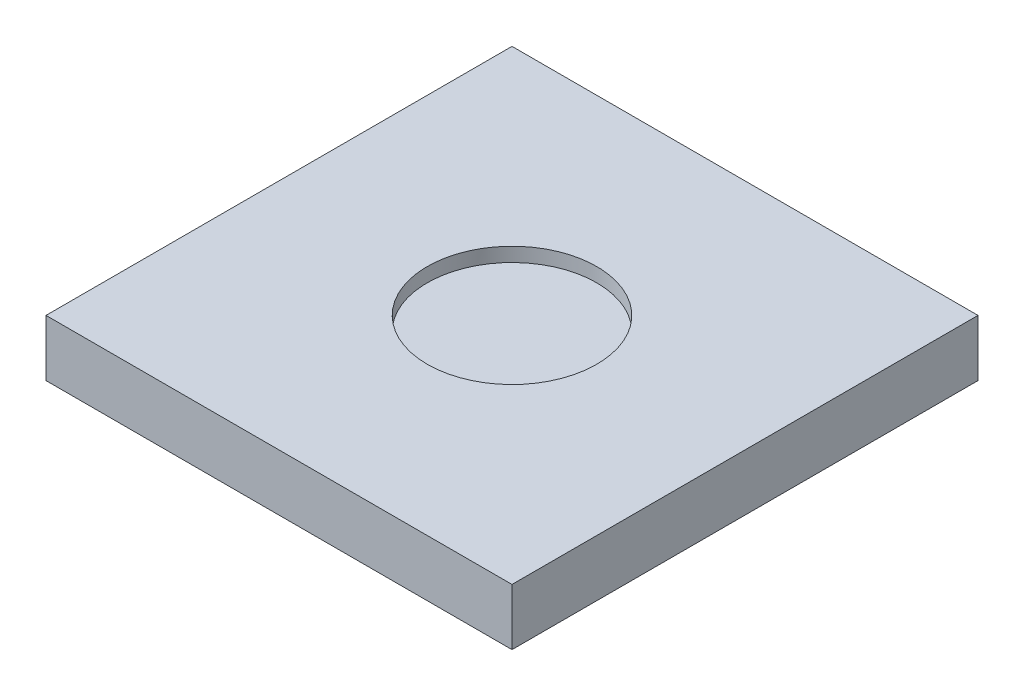
ISO-10303-21;
HEADER;
FILE_DESCRIPTION(('STEP AP214'),'2;1');
FILE_NAME('part.step','',(''),(''),'','','');
FILE_SCHEMA(('AUTOMOTIVE_DESIGN { 1 0 10303 214 1 1 1 1 }'));
ENDSEC;
DATA;
#1=APPLICATION_CONTEXT('core data for automotive mechanical design processes');
#2=APPLICATION_PROTOCOL_DEFINITION('international standard','automotive_design',2000,#1);
#3=PRODUCT_CONTEXT('',#1,'mechanical');
#4=PRODUCT('Part','Part','',(#3));
#5=PRODUCT_RELATED_PRODUCT_CATEGORY('part','',(#4));
#6=PRODUCT_DEFINITION_FORMATION('','',#4);
#7=PRODUCT_DEFINITION_CONTEXT('part definition',#1,'design');
#8=PRODUCT_DEFINITION('design','',#6,#7);
#9=PRODUCT_DEFINITION_SHAPE('','',#8);
#10=(LENGTH_UNIT() NAMED_UNIT(*) SI_UNIT(.MILLI.,.METRE.));
#11=(NAMED_UNIT(*) PLANE_ANGLE_UNIT() SI_UNIT($,.RADIAN.));
#12=(NAMED_UNIT(*) SI_UNIT($,.STERADIAN.) SOLID_ANGLE_UNIT());
#13=UNCERTAINTY_MEASURE_WITH_UNIT(LENGTH_MEASURE(1.E-05),#10,'distance_accuracy_value','');
#14=(GEOMETRIC_REPRESENTATION_CONTEXT(3) GLOBAL_UNCERTAINTY_ASSIGNED_CONTEXT((#13)) GLOBAL_UNIT_ASSIGNED_CONTEXT((#10,
#11,#12)) REPRESENTATION_CONTEXT('',''));
#15=CARTESIAN_POINT('',(0.,0.,0.));
#16=DIRECTION('',(0.,0.,1.));
#17=DIRECTION('',(1.,0.,0.));
#18=AXIS2_PLACEMENT_3D('',#15,#16,#17);
#19=CARTESIAN_POINT('',(0.,0.,0.));
#20=DIRECTION('',(0.,-1.,0.));
#21=DIRECTION('',(0.,0.,-1.));
#22=AXIS2_PLACEMENT_3D('',#19,#20,#21);
#23=PLANE('',#22);
#24=DIRECTION('',(0.,0.,-1.));
#25=VECTOR('',#24,1.);
#26=CARTESIAN_POINT('',(16.5,0.,16.5));
#27=LINE('',#26,#25);
#28=CARTESIAN_POINT('',(16.5,0.,16.5));
#29=VERTEX_POINT('',#28);
#30=CARTESIAN_POINT('',(16.5,0.,-16.5));
#31=VERTEX_POINT('',#30);
#32=EDGE_CURVE('E105',#29,#31,#27,.T.);
#33=ORIENTED_EDGE('',*,*,#32,.F.);
#34=DIRECTION('',(1.,0.,0.));
#35=VECTOR('',#34,1.);
#36=CARTESIAN_POINT('',(-16.5,0.,16.5));
#37=LINE('',#36,#35);
#38=CARTESIAN_POINT('',(-16.5,0.,16.5));
#39=VERTEX_POINT('',#38);
#40=EDGE_CURVE('E56',#39,#29,#37,.T.);
#41=ORIENTED_EDGE('',*,*,#40,.F.);
#42=DIRECTION('',(0.,0.,1.));
#43=VECTOR('',#42,1.);
#44=CARTESIAN_POINT('',(-16.5,0.,16.5));
#45=LINE('',#44,#43);
#46=CARTESIAN_POINT('',(-16.5,0.,-16.5));
#47=VERTEX_POINT('',#46);
#48=EDGE_CURVE('E162',#47,#39,#45,.T.);
#49=ORIENTED_EDGE('',*,*,#48,.F.);
#50=DIRECTION('',(-1.,0.,0.));
#51=VECTOR('',#50,1.);
#52=CARTESIAN_POINT('',(-16.5,0.,-16.5));
#53=LINE('',#52,#51);
#54=EDGE_CURVE('E160',#31,#47,#53,.T.);
#55=ORIENTED_EDGE('',*,*,#54,.F.);
#56=EDGE_LOOP('',(#33,#41,#49,#55));
#57=FACE_BOUND('',#56,.T.);
#58=DIRECTION('',(1.,0.,0.));
#59=VECTOR('',#58,1.);
#60=CARTESIAN_POINT('',(-15.5,0.,15.5));
#61=LINE('',#60,#59);
#62=CARTESIAN_POINT('',(-15.5,0.,15.5));
#63=VERTEX_POINT('',#62);
#64=CARTESIAN_POINT('',(15.5,0.,15.5));
#65=VERTEX_POINT('',#64);
#66=EDGE_CURVE('E133',#63,#65,#61,.T.);
#67=ORIENTED_EDGE('',*,*,#66,.T.);
#68=DIRECTION('',(0.,0.,-1.));
#69=VECTOR('',#68,1.);
#70=CARTESIAN_POINT('',(15.5,0.,15.5));
#71=LINE('',#70,#69);
#72=CARTESIAN_POINT('',(15.5,0.,-15.5));
#73=VERTEX_POINT('',#72);
#74=EDGE_CURVE('E48',#65,#73,#71,.T.);
#75=ORIENTED_EDGE('',*,*,#74,.T.);
#76=DIRECTION('',(-1.,0.,0.));
#77=VECTOR('',#76,1.);
#78=CARTESIAN_POINT('',(-15.5,0.,-15.5));
#79=LINE('',#78,#77);
#80=CARTESIAN_POINT('',(-15.5,0.,-15.5));
#81=VERTEX_POINT('',#80);
#82=EDGE_CURVE('E144',#73,#81,#79,.T.);
#83=ORIENTED_EDGE('',*,*,#82,.T.);
#84=DIRECTION('',(0.,0.,1.));
#85=VECTOR('',#84,1.);
#86=CARTESIAN_POINT('',(-15.5,0.,15.5));
#87=LINE('',#86,#85);
#88=EDGE_CURVE('E147',#81,#63,#87,.T.);
#89=ORIENTED_EDGE('',*,*,#88,.T.);
#90=EDGE_LOOP('',(#67,#75,#83,#89));
#91=FACE_BOUND('',#90,.T.);
#92=ADVANCED_FACE('F33',(#57,#91),#23,.T.);
#93=CARTESIAN_POINT('',(16.5,3.,16.5));
#94=DIRECTION('',(-1.,0.,0.));
#95=DIRECTION('',(0.,0.,1.));
#96=AXIS2_PLACEMENT_3D('',#93,#94,#95);
#97=PLANE('',#96);
#98=ORIENTED_EDGE('',*,*,#32,.T.);
#99=DIRECTION('',(0.,-1.,0.));
#100=VECTOR('',#99,1.);
#101=CARTESIAN_POINT('',(16.5,3.,-16.5));
#102=LINE('',#101,#100);
#103=CARTESIAN_POINT('',(16.5,4.,-16.5));
#104=VERTEX_POINT('',#103);
#105=EDGE_CURVE('E11',#104,#31,#102,.T.);
#106=ORIENTED_EDGE('',*,*,#105,.F.);
#107=DIRECTION('',(0.,0.,-1.));
#108=VECTOR('',#107,1.);
#109=CARTESIAN_POINT('',(16.5,4.,16.5));
#110=LINE('',#109,#108);
#111=CARTESIAN_POINT('',(16.5,4.,16.5));
#112=VERTEX_POINT('',#111);
#113=EDGE_CURVE('E103',#112,#104,#110,.T.);
#114=ORIENTED_EDGE('',*,*,#113,.F.);
#115=DIRECTION('',(0.,-1.,0.));
#116=VECTOR('',#115,1.);
#117=CARTESIAN_POINT('',(16.5,3.,16.5));
#118=LINE('',#117,#116);
#119=EDGE_CURVE('E165',#112,#29,#118,.T.);
#120=ORIENTED_EDGE('',*,*,#119,.T.);
#121=EDGE_LOOP('',(#98,#106,#114,#120));
#122=FACE_BOUND('',#121,.T.);
#123=ADVANCED_FACE('F35',(#122),#97,.F.);
#124=CARTESIAN_POINT('',(-16.5,3.,-16.5));
#125=DIRECTION('',(0.,0.,1.));
#126=DIRECTION('',(1.,0.,0.));
#127=AXIS2_PLACEMENT_3D('',#124,#125,#126);
#128=PLANE('',#127);
#129=ORIENTED_EDGE('',*,*,#54,.T.);
#130=DIRECTION('',(0.,-1.,0.));
#131=VECTOR('',#130,1.);
#132=CARTESIAN_POINT('',(-16.5,3.,-16.5));
#133=LINE('',#132,#131);
#134=CARTESIAN_POINT('',(-16.5,4.,-16.5));
#135=VERTEX_POINT('',#134);
#136=EDGE_CURVE('E41',#135,#47,#133,.T.);
#137=ORIENTED_EDGE('',*,*,#136,.F.);
#138=DIRECTION('',(-1.,0.,0.));
#139=VECTOR('',#138,1.);
#140=CARTESIAN_POINT('',(-16.5,4.,-16.5));
#141=LINE('',#140,#139);
#142=EDGE_CURVE('E108',#104,#135,#141,.T.);
#143=ORIENTED_EDGE('',*,*,#142,.F.);
#144=ORIENTED_EDGE('',*,*,#105,.T.);
#145=EDGE_LOOP('',(#129,#137,#143,#144));
#146=FACE_BOUND('',#145,.T.);
#147=ADVANCED_FACE('F109',(#146),#128,.F.);
#148=CARTESIAN_POINT('',(-16.5,3.,16.5));
#149=DIRECTION('',(1.,0.,0.));
#150=DIRECTION('',(0.,0.,-1.));
#151=AXIS2_PLACEMENT_3D('',#148,#149,#150);
#152=PLANE('',#151);
#153=ORIENTED_EDGE('',*,*,#48,.T.);
#154=DIRECTION('',(0.,-1.,0.));
#155=VECTOR('',#154,1.);
#156=CARTESIAN_POINT('',(-16.5,3.,16.5));
#157=LINE('',#156,#155);
#158=CARTESIAN_POINT('',(-16.5,4.,16.5));
#159=VERTEX_POINT('',#158);
#160=EDGE_CURVE('E167',#159,#39,#157,.T.);
#161=ORIENTED_EDGE('',*,*,#160,.F.);
#162=DIRECTION('',(0.,0.,1.));
#163=VECTOR('',#162,1.);
#164=CARTESIAN_POINT('',(-16.5,4.,16.5));
#165=LINE('',#164,#163);
#166=EDGE_CURVE('E114',#135,#159,#165,.T.);
#167=ORIENTED_EDGE('',*,*,#166,.F.);
#168=ORIENTED_EDGE('',*,*,#136,.T.);
#169=EDGE_LOOP('',(#153,#161,#167,#168));
#170=FACE_BOUND('',#169,.T.);
#171=ADVANCED_FACE('F170',(#170),#152,.F.);
#172=CARTESIAN_POINT('',(-16.5,3.,16.5));
#173=DIRECTION('',(0.,0.,-1.));
#174=DIRECTION('',(-1.,0.,0.));
#175=AXIS2_PLACEMENT_3D('',#172,#173,#174);
#176=PLANE('',#175);
#177=ORIENTED_EDGE('',*,*,#40,.T.);
#178=ORIENTED_EDGE('',*,*,#119,.F.);
#179=DIRECTION('',(1.,0.,0.));
#180=VECTOR('',#179,1.);
#181=CARTESIAN_POINT('',(-16.5,4.,16.5));
#182=LINE('',#181,#180);
#183=EDGE_CURVE('E119',#159,#112,#182,.T.);
#184=ORIENTED_EDGE('',*,*,#183,.F.);
#185=ORIENTED_EDGE('',*,*,#160,.T.);
#186=EDGE_LOOP('',(#177,#178,#184,#185));
#187=FACE_BOUND('',#186,.T.);
#188=ADVANCED_FACE('F208',(#187),#176,.F.);
#189=CARTESIAN_POINT('',(15.5,3.,15.5));
#190=DIRECTION('',(-1.,0.,0.));
#191=DIRECTION('',(0.,0.,1.));
#192=AXIS2_PLACEMENT_3D('',#189,#190,#191);
#193=PLANE('',#192);
#194=ORIENTED_EDGE('',*,*,#74,.F.);
#195=DIRECTION('',(0.,-1.,0.));
#196=VECTOR('',#195,1.);
#197=CARTESIAN_POINT('',(15.5,3.,15.5));
#198=LINE('',#197,#196);
#199=CARTESIAN_POINT('',(15.5,3.,15.5));
#200=VERTEX_POINT('',#199);
#201=EDGE_CURVE('E142',#200,#65,#198,.T.);
#202=ORIENTED_EDGE('',*,*,#201,.F.);
#203=DIRECTION('',(0.,0.,-1.));
#204=VECTOR('',#203,1.);
#205=CARTESIAN_POINT('',(15.5,3.,15.5));
#206=LINE('',#205,#204);
#207=CARTESIAN_POINT('',(15.5,3.,-15.5));
#208=VERTEX_POINT('',#207);
#209=EDGE_CURVE('E129',#200,#208,#206,.T.);
#210=ORIENTED_EDGE('',*,*,#209,.T.);
#211=DIRECTION('',(0.,-1.,0.));
#212=VECTOR('',#211,1.);
#213=CARTESIAN_POINT('',(15.5,3.,-15.5));
#214=LINE('',#213,#212);
#215=EDGE_CURVE('E157',#208,#73,#214,.T.);
#216=ORIENTED_EDGE('',*,*,#215,.T.);
#217=EDGE_LOOP('',(#194,#202,#210,#216));
#218=FACE_BOUND('',#217,.T.);
#219=ADVANCED_FACE('F180',(#218),#193,.T.);
#220=CARTESIAN_POINT('',(-15.5,3.,-15.5));
#221=DIRECTION('',(0.,0.,1.));
#222=DIRECTION('',(1.,0.,0.));
#223=AXIS2_PLACEMENT_3D('',#220,#221,#222);
#224=PLANE('',#223);
#225=ORIENTED_EDGE('',*,*,#82,.F.);
#226=ORIENTED_EDGE('',*,*,#215,.F.);
#227=DIRECTION('',(-1.,0.,0.));
#228=VECTOR('',#227,1.);
#229=CARTESIAN_POINT('',(-15.5,3.,-15.5));
#230=LINE('',#229,#228);
#231=CARTESIAN_POINT('',(-15.5,3.,-15.5));
#232=VERTEX_POINT('',#231);
#233=EDGE_CURVE('E132',#208,#232,#230,.T.);
#234=ORIENTED_EDGE('',*,*,#233,.T.);
#235=DIRECTION('',(0.,-1.,0.));
#236=VECTOR('',#235,1.);
#237=CARTESIAN_POINT('',(-15.5,3.,-15.5));
#238=LINE('',#237,#236);
#239=EDGE_CURVE('E155',#232,#81,#238,.T.);
#240=ORIENTED_EDGE('',*,*,#239,.T.);
#241=EDGE_LOOP('',(#225,#226,#234,#240));
#242=FACE_BOUND('',#241,.T.);
#243=ADVANCED_FACE('F184',(#242),#224,.T.);
#244=CARTESIAN_POINT('',(-15.5,3.,15.5));
#245=DIRECTION('',(1.,0.,0.));
#246=DIRECTION('',(0.,0.,-1.));
#247=AXIS2_PLACEMENT_3D('',#244,#245,#246);
#248=PLANE('',#247);
#249=ORIENTED_EDGE('',*,*,#88,.F.);
#250=ORIENTED_EDGE('',*,*,#239,.F.);
#251=DIRECTION('',(0.,0.,1.));
#252=VECTOR('',#251,1.);
#253=CARTESIAN_POINT('',(-15.5,3.,15.5));
#254=LINE('',#253,#252);
#255=CARTESIAN_POINT('',(-15.5,3.,15.5));
#256=VERTEX_POINT('',#255);
#257=EDGE_CURVE('E136',#232,#256,#254,.T.);
#258=ORIENTED_EDGE('',*,*,#257,.T.);
#259=DIRECTION('',(0.,-1.,0.));
#260=VECTOR('',#259,1.);
#261=CARTESIAN_POINT('',(-15.5,3.,15.5));
#262=LINE('',#261,#260);
#263=EDGE_CURVE('E153',#256,#63,#262,.T.);
#264=ORIENTED_EDGE('',*,*,#263,.T.);
#265=EDGE_LOOP('',(#249,#250,#258,#264));
#266=FACE_BOUND('',#265,.T.);
#267=ADVANCED_FACE('F187',(#266),#248,.T.);
#268=CARTESIAN_POINT('',(-15.5,3.,15.5));
#269=DIRECTION('',(0.,0.,-1.));
#270=DIRECTION('',(-1.,0.,0.));
#271=AXIS2_PLACEMENT_3D('',#268,#269,#270);
#272=PLANE('',#271);
#273=ORIENTED_EDGE('',*,*,#66,.F.);
#274=ORIENTED_EDGE('',*,*,#263,.F.);
#275=DIRECTION('',(1.,0.,0.));
#276=VECTOR('',#275,1.);
#277=CARTESIAN_POINT('',(-15.5,3.,15.5));
#278=LINE('',#277,#276);
#279=EDGE_CURVE('E139',#256,#200,#278,.T.);
#280=ORIENTED_EDGE('',*,*,#279,.T.);
#281=ORIENTED_EDGE('',*,*,#201,.T.);
#282=EDGE_LOOP('',(#273,#274,#280,#281));
#283=FACE_BOUND('',#282,.T.);
#284=ADVANCED_FACE('F179',(#283),#272,.T.);
#285=CARTESIAN_POINT('',(0.,3.,0.));
#286=DIRECTION('',(0.,-1.,0.));
#287=DIRECTION('',(0.,0.,-1.));
#288=AXIS2_PLACEMENT_3D('',#285,#286,#287);
#289=PLANE('',#288);
#290=CARTESIAN_POINT('',(0.,3.,0.));
#291=DIRECTION('',(0.,-1.,0.));
#292=DIRECTION('',(0.,0.,-1.));
#293=AXIS2_PLACEMENT_3D('',#290,#291,#292);
#294=CIRCLE('',#293,8.);
#295=CARTESIAN_POINT('',(0.,3.,-8.));
#296=VERTEX_POINT('',#295);
#297=EDGE_CURVE('E324',#296,#296,#294,.T.);
#298=ORIENTED_EDGE('',*,*,#297,.F.);
#299=EDGE_LOOP('',(#298));
#300=FACE_BOUND('',#299,.T.);
#301=ORIENTED_EDGE('',*,*,#209,.F.);
#302=ORIENTED_EDGE('',*,*,#279,.F.);
#303=ORIENTED_EDGE('',*,*,#257,.F.);
#304=ORIENTED_EDGE('',*,*,#233,.F.);
#305=EDGE_LOOP('',(#301,#302,#303,#304));
#306=FACE_BOUND('',#305,.T.);
#307=ADVANCED_FACE('F188',(#300,#306),#289,.T.);
#308=CARTESIAN_POINT('',(0.,4.,0.));
#309=DIRECTION('',(0.,-1.,0.));
#310=DIRECTION('',(0.,0.,-1.));
#311=AXIS2_PLACEMENT_3D('',#308,#309,#310);
#312=PLANE('',#311);
#313=CARTESIAN_POINT('',(0.,4.,0.));
#314=DIRECTION('',(0.,1.,0.));
#315=DIRECTION('',(0.,0.,1.));
#316=AXIS2_PLACEMENT_3D('',#313,#314,#315);
#317=CIRCLE('',#316,6.);
#318=CARTESIAN_POINT('',(0.,4.,6.));
#319=VERTEX_POINT('',#318);
#320=EDGE_CURVE('E120',#319,#319,#317,.T.);
#321=ORIENTED_EDGE('',*,*,#320,.F.);
#322=EDGE_LOOP('',(#321));
#323=FACE_BOUND('',#322,.T.);
#324=ORIENTED_EDGE('',*,*,#113,.T.);
#325=ORIENTED_EDGE('',*,*,#142,.T.);
#326=ORIENTED_EDGE('',*,*,#166,.T.);
#327=ORIENTED_EDGE('',*,*,#183,.T.);
#328=EDGE_LOOP('',(#324,#325,#326,#327));
#329=FACE_BOUND('',#328,.T.);
#330=ADVANCED_FACE('F117',(#323,#329),#312,.F.);
#331=CARTESIAN_POINT('',(0.,0.,0.));
#332=DIRECTION('',(0.,1.,0.));
#333=DIRECTION('',(0.,0.,1.));
#334=AXIS2_PLACEMENT_3D('',#331,#332,#333);
#335=CYLINDRICAL_SURFACE('',#334,6.);
#336=CARTESIAN_POINT('',(0.,3.,0.));
#337=DIRECTION('',(0.,-1.,0.));
#338=DIRECTION('',(0.,0.,-1.));
#339=AXIS2_PLACEMENT_3D('',#336,#337,#338);
#340=CIRCLE('',#339,6.);
#341=CARTESIAN_POINT('',(0.,3.,-6.));
#342=VERTEX_POINT('',#341);
#343=EDGE_CURVE('E123',#342,#342,#340,.F.);
#344=ORIENTED_EDGE('',*,*,#343,.F.);
#345=EDGE_LOOP('',(#344));
#346=FACE_BOUND('',#345,.T.);
#347=ORIENTED_EDGE('',*,*,#320,.T.);
#348=EDGE_LOOP('',(#347));
#349=FACE_BOUND('',#348,.T.);
#350=ADVANCED_FACE('F196',(#346,#349),#335,.F.);
#351=CARTESIAN_POINT('',(0.,3.,0.));
#352=DIRECTION('',(0.,-1.,0.));
#353=DIRECTION('',(0.,0.,-1.));
#354=AXIS2_PLACEMENT_3D('',#351,#352,#353);
#355=PLANE('',#354);
#356=ORIENTED_EDGE('',*,*,#343,.T.);
#357=EDGE_LOOP('',(#356));
#358=FACE_BOUND('',#357,.T.);
#359=ADVANCED_FACE('F284',(#358),#355,.F.);
#360=CARTESIAN_POINT('',(0.,2.,0.));
#361=DIRECTION('',(0.,1.,0.));
#362=DIRECTION('',(0.,0.,1.));
#363=AXIS2_PLACEMENT_3D('',#360,#361,#362);
#364=CYLINDRICAL_SURFACE('',#363,8.);
#365=CARTESIAN_POINT('',(0.,2.,0.));
#366=DIRECTION('',(0.,-1.,0.));
#367=DIRECTION('',(0.,0.,-1.));
#368=AXIS2_PLACEMENT_3D('',#365,#366,#367);
#369=CIRCLE('',#368,8.);
#370=CARTESIAN_POINT('',(0.,2.,-8.));
#371=VERTEX_POINT('',#370);
#372=EDGE_CURVE('E323',#371,#371,#369,.T.);
#373=ORIENTED_EDGE('',*,*,#372,.F.);
#374=EDGE_LOOP('',(#373));
#375=FACE_BOUND('',#374,.T.);
#376=ORIENTED_EDGE('',*,*,#297,.T.);
#377=EDGE_LOOP('',(#376));
#378=FACE_BOUND('',#377,.T.);
#379=ADVANCED_FACE('F297',(#375,#378),#364,.T.);
#380=CARTESIAN_POINT('',(0.,2.,0.));
#381=DIRECTION('',(0.,-1.,0.));
#382=DIRECTION('',(0.,0.,-1.));
#383=AXIS2_PLACEMENT_3D('',#380,#381,#382);
#384=PLANE('',#383);
#385=ORIENTED_EDGE('',*,*,#372,.T.);
#386=EDGE_LOOP('',(#385));
#387=FACE_BOUND('',#386,.T.);
#388=ADVANCED_FACE('F307',(#387),#384,.T.);
#389=CLOSED_SHELL('',(#92,#123,#147,#171,#188,#219,#243,#267,#284,#307,#330,#350,#359,#379,#388));
#390=MANIFOLD_SOLID_BREP('B2',#389);
#391=ADVANCED_BREP_SHAPE_REPRESENTATION('',(#18,#390),#14);
#392=SHAPE_DEFINITION_REPRESENTATION(#9,#391);
ENDSEC;
END-ISO-10303-21;
